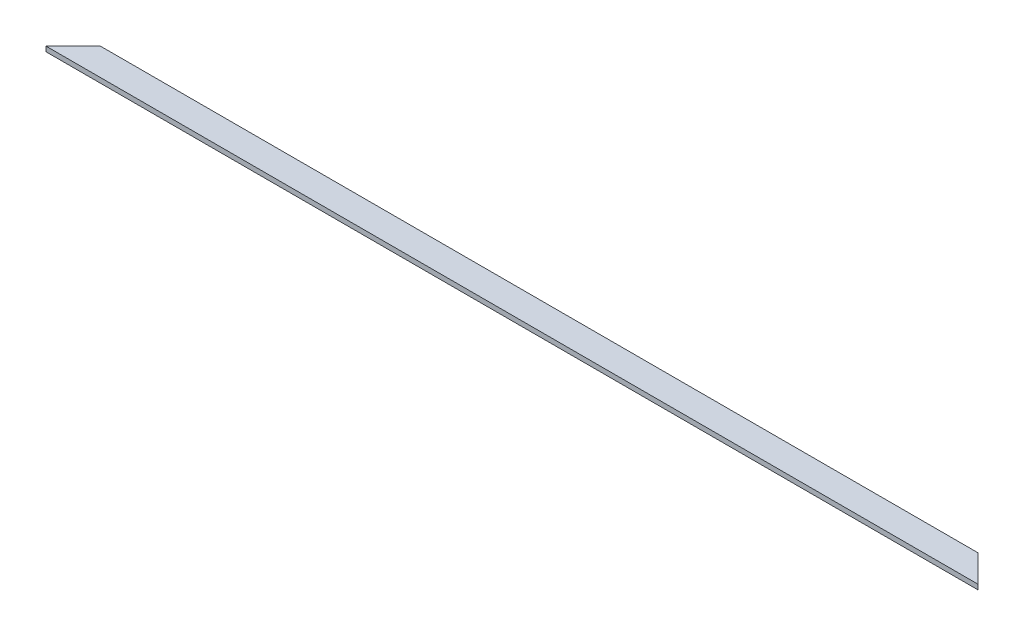
ISO-10303-21;
HEADER;
FILE_DESCRIPTION(('STEP AP214'),'2;1');
FILE_NAME('part.step','',(''),(''),'','','');
FILE_SCHEMA(('AUTOMOTIVE_DESIGN { 1 0 10303 214 1 1 1 1 }'));
ENDSEC;
DATA;
#1=APPLICATION_CONTEXT('core data for automotive mechanical design processes');
#2=APPLICATION_PROTOCOL_DEFINITION('international standard','automotive_design',2000,#1);
#3=PRODUCT_CONTEXT('',#1,'mechanical');
#4=PRODUCT('Part','Part','',(#3));
#5=PRODUCT_RELATED_PRODUCT_CATEGORY('part','',(#4));
#6=PRODUCT_DEFINITION_FORMATION('','',#4);
#7=PRODUCT_DEFINITION_CONTEXT('part definition',#1,'design');
#8=PRODUCT_DEFINITION('design','',#6,#7);
#9=PRODUCT_DEFINITION_SHAPE('','',#8);
#10=(LENGTH_UNIT() NAMED_UNIT(*) SI_UNIT(.MILLI.,.METRE.));
#11=(NAMED_UNIT(*) PLANE_ANGLE_UNIT() SI_UNIT($,.RADIAN.));
#12=(NAMED_UNIT(*) SI_UNIT($,.STERADIAN.) SOLID_ANGLE_UNIT());
#13=UNCERTAINTY_MEASURE_WITH_UNIT(LENGTH_MEASURE(1.E-05),#10,'distance_accuracy_value','');
#14=(GEOMETRIC_REPRESENTATION_CONTEXT(3) GLOBAL_UNCERTAINTY_ASSIGNED_CONTEXT((#13)) GLOBAL_UNIT_ASSIGNED_CONTEXT((#10,
#11,#12)) REPRESENTATION_CONTEXT('',''));
#15=CARTESIAN_POINT('',(0.,0.,0.));
#16=DIRECTION('',(0.,0.,1.));
#17=DIRECTION('',(1.,0.,0.));
#18=AXIS2_PLACEMENT_3D('',#15,#16,#17);
#19=CARTESIAN_POINT('',(0.,25.4,0.));
#20=DIRECTION('',(0.707106781186549,0.,0.707106781186546));
#21=DIRECTION('',(0.707106781186546,0.,-0.707106781186549));
#22=AXIS2_PLACEMENT_3D('',#19,#20,#21);
#23=PLANE('',#22);
#24=DIRECTION('',(-0.707106781186546,0.,0.707106781186549));
#25=VECTOR('',#24,1.);
#26=CARTESIAN_POINT('',(0.,0.,0.));
#27=LINE('',#26,#25);
#28=CARTESIAN_POINT('',(139.699999999999,0.,-139.7));
#29=VERTEX_POINT('',#28);
#30=CARTESIAN_POINT('',(0.,0.,0.));
#31=VERTEX_POINT('',#30);
#32=EDGE_CURVE('E96',#29,#31,#27,.T.);
#33=ORIENTED_EDGE('',*,*,#32,.T.);
#34=DIRECTION('',(0.,-1.,0.));
#35=VECTOR('',#34,1.);
#36=CARTESIAN_POINT('',(0.,25.4,0.));
#37=LINE('',#36,#35);
#38=CARTESIAN_POINT('',(0.,25.4,0.));
#39=VERTEX_POINT('',#38);
#40=EDGE_CURVE('E11',#39,#31,#37,.T.);
#41=ORIENTED_EDGE('',*,*,#40,.F.);
#42=DIRECTION('',(-0.707106781186546,0.,0.707106781186549));
#43=VECTOR('',#42,1.);
#44=CARTESIAN_POINT('',(0.,25.4,0.));
#45=LINE('',#44,#43);
#46=CARTESIAN_POINT('',(139.699999999999,25.4,-139.7));
#47=VERTEX_POINT('',#46);
#48=EDGE_CURVE('E84',#47,#39,#45,.T.);
#49=ORIENTED_EDGE('',*,*,#48,.F.);
#50=DIRECTION('',(0.,-1.,0.));
#51=VECTOR('',#50,1.);
#52=CARTESIAN_POINT('',(139.699999999999,25.4,-139.7));
#53=LINE('',#52,#51);
#54=EDGE_CURVE('E92',#47,#29,#53,.T.);
#55=ORIENTED_EDGE('',*,*,#54,.T.);
#56=EDGE_LOOP('',(#33,#41,#49,#55));
#57=FACE_BOUND('',#56,.T.);
#58=ADVANCED_FACE('F33',(#57),#23,.F.);
#59=CARTESIAN_POINT('',(0.,25.4,0.));
#60=DIRECTION('',(0.,0.,-1.));
#61=DIRECTION('',(-1.,0.,0.));
#62=AXIS2_PLACEMENT_3D('',#59,#60,#61);
#63=PLANE('',#62);
#64=DIRECTION('',(1.,0.,0.));
#65=VECTOR('',#64,1.);
#66=CARTESIAN_POINT('',(0.,0.,0.));
#67=LINE('',#66,#65);
#68=CARTESIAN_POINT('',(4787.9,0.,0.));
#69=VERTEX_POINT('',#68);
#70=EDGE_CURVE('E88',#31,#69,#67,.T.);
#71=ORIENTED_EDGE('',*,*,#70,.T.);
#72=DIRECTION('',(0.,-1.,0.));
#73=VECTOR('',#72,1.);
#74=CARTESIAN_POINT('',(4787.9,25.4,0.));
#75=LINE('',#74,#73);
#76=CARTESIAN_POINT('',(4787.9,25.4,0.));
#77=VERTEX_POINT('',#76);
#78=EDGE_CURVE('E41',#77,#69,#75,.T.);
#79=ORIENTED_EDGE('',*,*,#78,.F.);
#80=DIRECTION('',(1.,0.,0.));
#81=VECTOR('',#80,1.);
#82=CARTESIAN_POINT('',(0.,25.4,0.));
#83=LINE('',#82,#81);
#84=EDGE_CURVE('E79',#39,#77,#83,.T.);
#85=ORIENTED_EDGE('',*,*,#84,.F.);
#86=ORIENTED_EDGE('',*,*,#40,.T.);
#87=EDGE_LOOP('',(#71,#79,#85,#86));
#88=FACE_BOUND('',#87,.T.);
#89=ADVANCED_FACE('F87',(#88),#63,.F.);
#90=CARTESIAN_POINT('',(4787.9,25.4,0.));
#91=DIRECTION('',(-0.707106781186544,0.,0.707106781186551));
#92=DIRECTION('',(0.707106781186551,0.,0.707106781186544));
#93=AXIS2_PLACEMENT_3D('',#90,#91,#92);
#94=PLANE('',#93);
#95=DIRECTION('',(-0.707106781186551,0.,-0.707106781186544));
#96=VECTOR('',#95,1.);
#97=CARTESIAN_POINT('',(4787.9,0.,0.));
#98=LINE('',#97,#96);
#99=CARTESIAN_POINT('',(4648.2,0.,-139.7));
#100=VERTEX_POINT('',#99);
#101=EDGE_CURVE('E66',#69,#100,#98,.T.);
#102=ORIENTED_EDGE('',*,*,#101,.T.);
#103=DIRECTION('',(0.,-1.,0.));
#104=VECTOR('',#103,1.);
#105=CARTESIAN_POINT('',(4648.2,25.4,-139.7));
#106=LINE('',#105,#104);
#107=CARTESIAN_POINT('',(4648.2,25.4,-139.7));
#108=VERTEX_POINT('',#107);
#109=EDGE_CURVE('E89',#108,#100,#106,.T.);
#110=ORIENTED_EDGE('',*,*,#109,.F.);
#111=DIRECTION('',(-0.707106781186551,0.,-0.707106781186544));
#112=VECTOR('',#111,1.);
#113=CARTESIAN_POINT('',(4787.9,25.4,0.));
#114=LINE('',#113,#112);
#115=EDGE_CURVE('E82',#77,#108,#114,.T.);
#116=ORIENTED_EDGE('',*,*,#115,.F.);
#117=ORIENTED_EDGE('',*,*,#78,.T.);
#118=EDGE_LOOP('',(#102,#110,#116,#117));
#119=FACE_BOUND('',#118,.T.);
#120=ADVANCED_FACE('F90',(#119),#94,.F.);
#121=CARTESIAN_POINT('',(139.699999999999,25.4,-139.7));
#122=DIRECTION('',(0.,0.,1.));
#123=DIRECTION('',(1.,0.,0.));
#124=AXIS2_PLACEMENT_3D('',#121,#122,#123);
#125=PLANE('',#124);
#126=DIRECTION('',(-1.,0.,0.));
#127=VECTOR('',#126,1.);
#128=CARTESIAN_POINT('',(139.699999999999,0.,-139.7));
#129=LINE('',#128,#127);
#130=EDGE_CURVE('E72',#100,#29,#129,.T.);
#131=ORIENTED_EDGE('',*,*,#130,.T.);
#132=ORIENTED_EDGE('',*,*,#54,.F.);
#133=DIRECTION('',(-1.,0.,0.));
#134=VECTOR('',#133,1.);
#135=CARTESIAN_POINT('',(139.699999999999,25.4,-139.7));
#136=LINE('',#135,#134);
#137=EDGE_CURVE('E49',#108,#47,#136,.T.);
#138=ORIENTED_EDGE('',*,*,#137,.F.);
#139=ORIENTED_EDGE('',*,*,#109,.T.);
#140=EDGE_LOOP('',(#131,#132,#138,#139));
#141=FACE_BOUND('',#140,.T.);
#142=ADVANCED_FACE('F103',(#141),#125,.F.);
#143=CARTESIAN_POINT('',(0.,25.4,0.));
#144=DIRECTION('',(0.,1.,0.));
#145=DIRECTION('',(0.,0.,1.));
#146=AXIS2_PLACEMENT_3D('',#143,#144,#145);
#147=PLANE('',#146);
#148=ORIENTED_EDGE('',*,*,#48,.T.);
#149=ORIENTED_EDGE('',*,*,#84,.T.);
#150=ORIENTED_EDGE('',*,*,#115,.T.);
#151=ORIENTED_EDGE('',*,*,#137,.T.);
#152=EDGE_LOOP('',(#148,#149,#150,#151));
#153=FACE_BOUND('',#152,.T.);
#154=ADVANCED_FACE('F80',(#153),#147,.T.);
#155=CARTESIAN_POINT('',(0.,0.,0.));
#156=DIRECTION('',(0.,1.,0.));
#157=DIRECTION('',(0.,0.,1.));
#158=AXIS2_PLACEMENT_3D('',#155,#156,#157);
#159=PLANE('',#158);
#160=ORIENTED_EDGE('',*,*,#32,.F.);
#161=ORIENTED_EDGE('',*,*,#130,.F.);
#162=ORIENTED_EDGE('',*,*,#101,.F.);
#163=ORIENTED_EDGE('',*,*,#70,.F.);
#164=EDGE_LOOP('',(#160,#161,#162,#163));
#165=FACE_BOUND('',#164,.T.);
#166=ADVANCED_FACE('F106',(#165),#159,.F.);
#167=CLOSED_SHELL('',(#58,#89,#120,#142,#154,#166));
#168=MANIFOLD_SOLID_BREP('B2',#167);
#169=ADVANCED_BREP_SHAPE_REPRESENTATION('',(#18,#168),#14);
#170=SHAPE_DEFINITION_REPRESENTATION(#9,#169);
ENDSEC;
END-ISO-10303-21;
